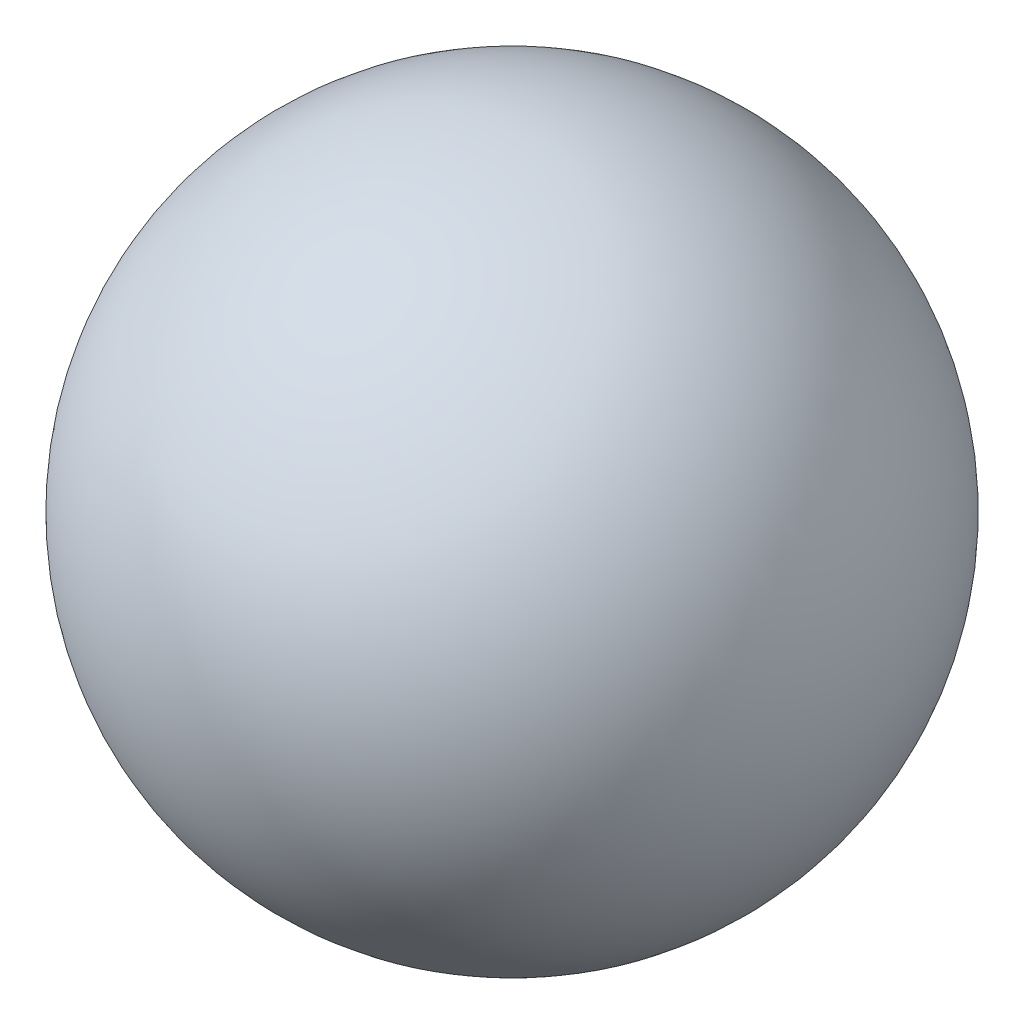
ISO-10303-21;
HEADER;
FILE_DESCRIPTION(('STEP AP214'),'2;1');
FILE_NAME('part.step','',(''),(''),'','','');
FILE_SCHEMA(('AUTOMOTIVE_DESIGN { 1 0 10303 214 1 1 1 1 }'));
ENDSEC;
DATA;
#1=APPLICATION_CONTEXT('core data for automotive mechanical design processes');
#2=APPLICATION_PROTOCOL_DEFINITION('international standard','automotive_design',2000,#1);
#3=PRODUCT_CONTEXT('',#1,'mechanical');
#4=PRODUCT('Part','Part','',(#3));
#5=PRODUCT_RELATED_PRODUCT_CATEGORY('part','',(#4));
#6=PRODUCT_DEFINITION_FORMATION('','',#4);
#7=PRODUCT_DEFINITION_CONTEXT('part definition',#1,'design');
#8=PRODUCT_DEFINITION('design','',#6,#7);
#9=PRODUCT_DEFINITION_SHAPE('','',#8);
#10=(LENGTH_UNIT() NAMED_UNIT(*) SI_UNIT(.MILLI.,.METRE.));
#11=(NAMED_UNIT(*) PLANE_ANGLE_UNIT() SI_UNIT($,.RADIAN.));
#12=(NAMED_UNIT(*) SI_UNIT($,.STERADIAN.) SOLID_ANGLE_UNIT());
#13=UNCERTAINTY_MEASURE_WITH_UNIT(LENGTH_MEASURE(1.E-05),#10,'distance_accuracy_value','');
#14=(GEOMETRIC_REPRESENTATION_CONTEXT(3) GLOBAL_UNCERTAINTY_ASSIGNED_CONTEXT((#13)) GLOBAL_UNIT_ASSIGNED_CONTEXT((#10,
#11,#12)) REPRESENTATION_CONTEXT('',''));
#15=CARTESIAN_POINT('',(0.,0.,0.));
#16=DIRECTION('',(0.,0.,1.));
#17=DIRECTION('',(1.,0.,0.));
#18=AXIS2_PLACEMENT_3D('',#15,#16,#17);
#19=CARTESIAN_POINT('',(0.,0.,0.));
#20=DIRECTION('',(0.,1.,0.));
#21=DIRECTION('',(1.,0.,0.));
#22=AXIS2_PLACEMENT_3D('',#19,#20,#21);
#23=SPHERICAL_SURFACE('',#22,0.889);
#24=CARTESIAN_POINT('',(0.,0.889,0.));
#25=VERTEX_POINT('',#24);
#26=VERTEX_LOOP('',#25);
#27=FACE_BOUND('',#26,.T.);
#28=ADVANCED_FACE('F38',(#27),#23,.T.);
#29=CLOSED_SHELL('',(#28));
#30=MANIFOLD_SOLID_BREP('B2',#29);
#31=ADVANCED_BREP_SHAPE_REPRESENTATION('',(#18,#30),#14);
#32=SHAPE_DEFINITION_REPRESENTATION(#9,#31);
ENDSEC;
END-ISO-10303-21;
